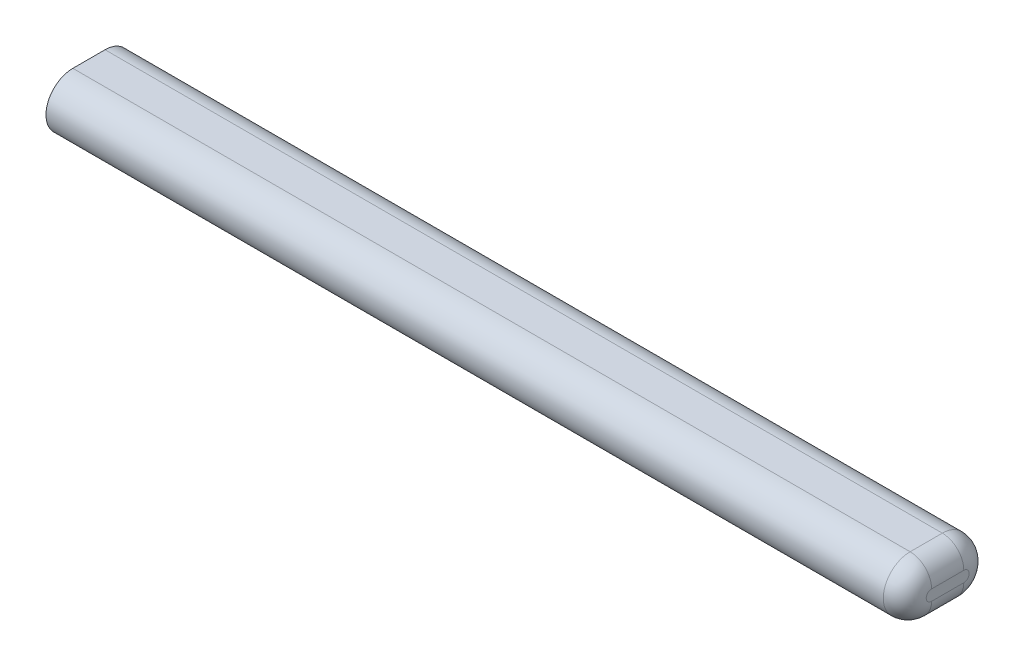
ISO-10303-21;
HEADER;
FILE_DESCRIPTION(('STEP AP214'),'2;1');
FILE_NAME('part.step','',(''),(''),'','','');
FILE_SCHEMA(('AUTOMOTIVE_DESIGN { 1 0 10303 214 1 1 1 1 }'));
ENDSEC;
DATA;
#1=APPLICATION_CONTEXT('core data for automotive mechanical design processes');
#2=APPLICATION_PROTOCOL_DEFINITION('international standard','automotive_design',2000,#1);
#3=PRODUCT_CONTEXT('',#1,'mechanical');
#4=PRODUCT('Part','Part','',(#3));
#5=PRODUCT_RELATED_PRODUCT_CATEGORY('part','',(#4));
#6=PRODUCT_DEFINITION_FORMATION('','',#4);
#7=PRODUCT_DEFINITION_CONTEXT('part definition',#1,'design');
#8=PRODUCT_DEFINITION('design','',#6,#7);
#9=PRODUCT_DEFINITION_SHAPE('','',#8);
#10=(LENGTH_UNIT() NAMED_UNIT(*) SI_UNIT(.MILLI.,.METRE.));
#11=(NAMED_UNIT(*) PLANE_ANGLE_UNIT() SI_UNIT($,.RADIAN.));
#12=(NAMED_UNIT(*) SI_UNIT($,.STERADIAN.) SOLID_ANGLE_UNIT());
#13=UNCERTAINTY_MEASURE_WITH_UNIT(LENGTH_MEASURE(1.E-05),#10,'distance_accuracy_value','');
#14=(GEOMETRIC_REPRESENTATION_CONTEXT(3) GLOBAL_UNCERTAINTY_ASSIGNED_CONTEXT((#13)) GLOBAL_UNIT_ASSIGNED_CONTEXT((#10,
#11,#12)) REPRESENTATION_CONTEXT('',''));
#15=CARTESIAN_POINT('',(0.,0.,0.));
#16=DIRECTION('',(0.,0.,1.));
#17=DIRECTION('',(1.,0.,0.));
#18=AXIS2_PLACEMENT_3D('',#15,#16,#17);
#19=CARTESIAN_POINT('',(400.,0.,0.));
#20=DIRECTION('',(-1.,0.,0.));
#21=DIRECTION('',(0.,0.,1.));
#22=AXIS2_PLACEMENT_3D('',#19,#20,#21);
#23=CYLINDRICAL_SURFACE('',#22,12.5);
#24=DIRECTION('',(-1.,0.,0.));
#25=VECTOR('',#24,1.);
#26=CARTESIAN_POINT('',(400.,-12.5,0.));
#27=LINE('',#26,#25);
#28=CARTESIAN_POINT('',(390.,-12.5,0.));
#29=VERTEX_POINT('',#28);
#30=CARTESIAN_POINT('',(0.,-12.5,0.));
#31=VERTEX_POINT('',#30);
#32=EDGE_CURVE('E92',#29,#31,#27,.T.);
#33=ORIENTED_EDGE('',*,*,#32,.F.);
#34=CARTESIAN_POINT('',(390.,0.,0.));
#35=DIRECTION('',(1.,0.,0.));
#36=DIRECTION('',(0.,0.,-1.));
#37=AXIS2_PLACEMENT_3D('',#34,#35,#36);
#38=CIRCLE('',#37,12.5);
#39=CARTESIAN_POINT('',(390.,12.5,0.));
#40=VERTEX_POINT('',#39);
#41=EDGE_CURVE('E11',#29,#40,#38,.F.);
#42=ORIENTED_EDGE('',*,*,#41,.T.);
#43=DIRECTION('',(-1.,0.,0.));
#44=VECTOR('',#43,1.);
#45=CARTESIAN_POINT('',(400.,12.5,0.));
#46=LINE('',#45,#44);
#47=CARTESIAN_POINT('',(0.,12.5,0.));
#48=VERTEX_POINT('',#47);
#49=EDGE_CURVE('E114',#40,#48,#46,.T.);
#50=ORIENTED_EDGE('',*,*,#49,.T.);
#51=CARTESIAN_POINT('',(0.,0.,0.));
#52=DIRECTION('',(1.,0.,0.));
#53=DIRECTION('',(0.,0.,-1.));
#54=AXIS2_PLACEMENT_3D('',#51,#52,#53);
#55=CIRCLE('',#54,12.5);
#56=EDGE_CURVE('E108',#48,#31,#55,.T.);
#57=ORIENTED_EDGE('',*,*,#56,.T.);
#58=EDGE_LOOP('',(#33,#42,#50,#57));
#59=FACE_BOUND('',#58,.T.);
#60=ADVANCED_FACE('F39',(#59),#23,.T.);
#61=CARTESIAN_POINT('',(400.,-12.5,0.));
#62=DIRECTION('',(0.,1.,0.));
#63=DIRECTION('',(0.,0.,1.));
#64=AXIS2_PLACEMENT_3D('',#61,#62,#63);
#65=PLANE('',#64);
#66=DIRECTION('',(-1.,0.,0.));
#67=VECTOR('',#66,1.);
#68=CARTESIAN_POINT('',(400.,-12.5,-15.));
#69=LINE('',#68,#67);
#70=CARTESIAN_POINT('',(390.,-12.5,-15.));
#71=VERTEX_POINT('',#70);
#72=CARTESIAN_POINT('',(0.,-12.5,-15.));
#73=VERTEX_POINT('',#72);
#74=EDGE_CURVE('E102',#71,#73,#69,.T.);
#75=ORIENTED_EDGE('',*,*,#74,.F.);
#76=DIRECTION('',(0.,0.,-1.));
#77=VECTOR('',#76,1.);
#78=CARTESIAN_POINT('',(390.,-12.5,0.));
#79=LINE('',#78,#77);
#80=EDGE_CURVE('E49',#71,#29,#79,.F.);
#81=ORIENTED_EDGE('',*,*,#80,.T.);
#82=ORIENTED_EDGE('',*,*,#32,.T.);
#83=DIRECTION('',(0.,0.,-1.));
#84=VECTOR('',#83,1.);
#85=CARTESIAN_POINT('',(0.,-12.5,0.));
#86=LINE('',#85,#84);
#87=EDGE_CURVE('E95',#31,#73,#86,.T.);
#88=ORIENTED_EDGE('',*,*,#87,.T.);
#89=EDGE_LOOP('',(#75,#81,#82,#88));
#90=FACE_BOUND('',#89,.T.);
#91=ADVANCED_FACE('F94',(#90),#65,.F.);
#92=CARTESIAN_POINT('',(400.,0.,-15.));
#93=DIRECTION('',(-1.,0.,0.));
#94=DIRECTION('',(0.,0.,1.));
#95=AXIS2_PLACEMENT_3D('',#92,#93,#94);
#96=CYLINDRICAL_SURFACE('',#95,12.5);
#97=DIRECTION('',(-1.,0.,0.));
#98=VECTOR('',#97,1.);
#99=CARTESIAN_POINT('',(400.,12.5,-15.));
#100=LINE('',#99,#98);
#101=CARTESIAN_POINT('',(390.,12.5,-15.));
#102=VERTEX_POINT('',#101);
#103=CARTESIAN_POINT('',(0.,12.5,-15.));
#104=VERTEX_POINT('',#103);
#105=EDGE_CURVE('E129',#102,#104,#100,.T.);
#106=ORIENTED_EDGE('',*,*,#105,.F.);
#107=CARTESIAN_POINT('',(390.,0.,-15.));
#108=DIRECTION('',(1.,0.,0.));
#109=DIRECTION('',(0.,0.,-1.));
#110=AXIS2_PLACEMENT_3D('',#107,#108,#109);
#111=CIRCLE('',#110,12.5);
#112=EDGE_CURVE('E64',#102,#71,#111,.F.);
#113=ORIENTED_EDGE('',*,*,#112,.T.);
#114=ORIENTED_EDGE('',*,*,#74,.T.);
#115=CARTESIAN_POINT('',(0.,0.,-15.));
#116=DIRECTION('',(1.,0.,0.));
#117=DIRECTION('',(0.,0.,-1.));
#118=AXIS2_PLACEMENT_3D('',#115,#116,#117);
#119=CIRCLE('',#118,12.5);
#120=EDGE_CURVE('E110',#73,#104,#119,.T.);
#121=ORIENTED_EDGE('',*,*,#120,.T.);
#122=EDGE_LOOP('',(#106,#113,#114,#121));
#123=FACE_BOUND('',#122,.T.);
#124=ADVANCED_FACE('F179',(#123),#96,.T.);
#125=CARTESIAN_POINT('',(400.,12.5,0.));
#126=DIRECTION('',(0.,-1.,0.));
#127=DIRECTION('',(0.,0.,-1.));
#128=AXIS2_PLACEMENT_3D('',#125,#126,#127);
#129=PLANE('',#128);
#130=ORIENTED_EDGE('',*,*,#49,.F.);
#131=DIRECTION('',(0.,0.,1.));
#132=VECTOR('',#131,1.);
#133=CARTESIAN_POINT('',(390.,12.5,-15.));
#134=LINE('',#133,#132);
#135=EDGE_CURVE('E146',#40,#102,#134,.F.);
#136=ORIENTED_EDGE('',*,*,#135,.T.);
#137=ORIENTED_EDGE('',*,*,#105,.T.);
#138=DIRECTION('',(0.,0.,1.));
#139=VECTOR('',#138,1.);
#140=CARTESIAN_POINT('',(0.,12.5,0.));
#141=LINE('',#140,#139);
#142=EDGE_CURVE('E124',#104,#48,#141,.T.);
#143=ORIENTED_EDGE('',*,*,#142,.T.);
#144=EDGE_LOOP('',(#130,#136,#137,#143));
#145=FACE_BOUND('',#144,.T.);
#146=ADVANCED_FACE('F178',(#145),#129,.F.);
#147=CARTESIAN_POINT('',(400.,0.,0.));
#148=DIRECTION('',(1.,0.,0.));
#149=DIRECTION('',(0.,0.,-1.));
#150=AXIS2_PLACEMENT_3D('',#147,#148,#149);
#151=PLANE('',#150);
#152=CARTESIAN_POINT('',(400.,0.,-15.));
#153=DIRECTION('',(1.,0.,0.));
#154=DIRECTION('',(0.,0.,-1.));
#155=AXIS2_PLACEMENT_3D('',#152,#153,#154);
#156=CIRCLE('',#155,2.5);
#157=CARTESIAN_POINT('',(400.,-2.5,-15.));
#158=VERTEX_POINT('',#157);
#159=CARTESIAN_POINT('',(400.,2.5,-15.));
#160=VERTEX_POINT('',#159);
#161=EDGE_CURVE('E139',#158,#160,#156,.T.);
#162=ORIENTED_EDGE('',*,*,#161,.T.);
#163=DIRECTION('',(0.,0.,1.));
#164=VECTOR('',#163,1.);
#165=CARTESIAN_POINT('',(400.,2.5,0.));
#166=LINE('',#165,#164);
#167=CARTESIAN_POINT('',(400.,2.5,0.));
#168=VERTEX_POINT('',#167);
#169=EDGE_CURVE('E142',#160,#168,#166,.T.);
#170=ORIENTED_EDGE('',*,*,#169,.T.);
#171=CARTESIAN_POINT('',(400.,0.,0.));
#172=DIRECTION('',(1.,0.,0.));
#173=DIRECTION('',(0.,0.,-1.));
#174=AXIS2_PLACEMENT_3D('',#171,#172,#173);
#175=CIRCLE('',#174,2.5);
#176=CARTESIAN_POINT('',(400.,-2.5,0.));
#177=VERTEX_POINT('',#176);
#178=EDGE_CURVE('E101',#168,#177,#175,.T.);
#179=ORIENTED_EDGE('',*,*,#178,.T.);
#180=DIRECTION('',(0.,0.,-1.));
#181=VECTOR('',#180,1.);
#182=CARTESIAN_POINT('',(400.,-2.5,-15.));
#183=LINE('',#182,#181);
#184=EDGE_CURVE('E136',#177,#158,#183,.T.);
#185=ORIENTED_EDGE('',*,*,#184,.T.);
#186=EDGE_LOOP('',(#162,#170,#179,#185));
#187=FACE_BOUND('',#186,.T.);
#188=ADVANCED_FACE('F171',(#187),#151,.T.);
#189=CARTESIAN_POINT('',(0.,0.,0.));
#190=DIRECTION('',(1.,0.,0.));
#191=DIRECTION('',(0.,0.,-1.));
#192=AXIS2_PLACEMENT_3D('',#189,#190,#191);
#193=PLANE('',#192);
#194=ORIENTED_EDGE('',*,*,#56,.F.);
#195=ORIENTED_EDGE('',*,*,#142,.F.);
#196=ORIENTED_EDGE('',*,*,#120,.F.);
#197=ORIENTED_EDGE('',*,*,#87,.F.);
#198=EDGE_LOOP('',(#194,#195,#196,#197));
#199=FACE_BOUND('',#198,.T.);
#200=ADVANCED_FACE('F106',(#199),#193,.F.);
#201=CARTESIAN_POINT('',(390.,-2.5,0.));
#202=DIRECTION('',(0.,0.,1.));
#203=DIRECTION('',(1.,0.,0.));
#204=AXIS2_PLACEMENT_3D('',#201,#202,#203);
#205=CYLINDRICAL_SURFACE('',#204,10.);
#206=CARTESIAN_POINT('',(390.,-2.5,0.));
#207=DIRECTION('',(0.,0.,1.));
#208=DIRECTION('',(1.,0.,0.));
#209=AXIS2_PLACEMENT_3D('',#206,#207,#208);
#210=CIRCLE('',#209,10.);
#211=EDGE_CURVE('E120',#29,#177,#210,.T.);
#212=ORIENTED_EDGE('',*,*,#211,.F.);
#213=ORIENTED_EDGE('',*,*,#80,.F.);
#214=CARTESIAN_POINT('',(390.,-2.5,-15.));
#215=DIRECTION('',(0.,0.,-1.));
#216=DIRECTION('',(0.,1.,0.));
#217=AXIS2_PLACEMENT_3D('',#214,#215,#216);
#218=CIRCLE('',#217,10.);
#219=EDGE_CURVE('E43',#158,#71,#218,.T.);
#220=ORIENTED_EDGE('',*,*,#219,.F.);
#221=ORIENTED_EDGE('',*,*,#184,.F.);
#222=EDGE_LOOP('',(#212,#213,#220,#221));
#223=FACE_BOUND('',#222,.T.);
#224=ADVANCED_FACE('F41',(#223),#205,.T.);
#225=CARTESIAN_POINT('',(390.,0.,-15.));
#226=DIRECTION('',(1.,0.,0.));
#227=DIRECTION('',(0.,0.,-1.));
#228=AXIS2_PLACEMENT_3D('',#225,#226,#227);
#229=DEGENERATE_TOROIDAL_SURFACE('',#228,2.5,10.,.T.);
#230=ORIENTED_EDGE('',*,*,#219,.T.);
#231=ORIENTED_EDGE('',*,*,#112,.F.);
#232=CARTESIAN_POINT('',(390.,2.5,-15.));
#233=DIRECTION('',(0.,0.,1.));
#234=DIRECTION('',(1.,0.,0.));
#235=AXIS2_PLACEMENT_3D('',#232,#233,#234);
#236=CIRCLE('',#235,10.);
#237=EDGE_CURVE('E157',#160,#102,#236,.T.);
#238=ORIENTED_EDGE('',*,*,#237,.F.);
#239=ORIENTED_EDGE('',*,*,#161,.F.);
#240=EDGE_LOOP('',(#230,#231,#238,#239));
#241=FACE_BOUND('',#240,.T.);
#242=ADVANCED_FACE('F196',(#241),#229,.T.);
#243=CARTESIAN_POINT('',(390.,0.,0.));
#244=DIRECTION('',(1.,0.,0.));
#245=DIRECTION('',(0.,0.,-1.));
#246=AXIS2_PLACEMENT_3D('',#243,#244,#245);
#247=DEGENERATE_TOROIDAL_SURFACE('',#246,2.5,10.,.T.);
#248=ORIENTED_EDGE('',*,*,#211,.T.);
#249=ORIENTED_EDGE('',*,*,#178,.F.);
#250=CARTESIAN_POINT('',(390.,2.5,0.));
#251=DIRECTION('',(0.,0.,-1.));
#252=DIRECTION('',(-1.,0.,0.));
#253=AXIS2_PLACEMENT_3D('',#250,#251,#252);
#254=CIRCLE('',#253,10.);
#255=EDGE_CURVE('E154',#40,#168,#254,.T.);
#256=ORIENTED_EDGE('',*,*,#255,.F.);
#257=ORIENTED_EDGE('',*,*,#41,.F.);
#258=EDGE_LOOP('',(#248,#249,#256,#257));
#259=FACE_BOUND('',#258,.T.);
#260=ADVANCED_FACE('F164',(#259),#247,.T.);
#261=CARTESIAN_POINT('',(390.,2.5,0.));
#262=DIRECTION('',(0.,0.,-1.));
#263=DIRECTION('',(-1.,0.,0.));
#264=AXIS2_PLACEMENT_3D('',#261,#262,#263);
#265=CYLINDRICAL_SURFACE('',#264,10.);
#266=ORIENTED_EDGE('',*,*,#237,.T.);
#267=ORIENTED_EDGE('',*,*,#135,.F.);
#268=ORIENTED_EDGE('',*,*,#255,.T.);
#269=ORIENTED_EDGE('',*,*,#169,.F.);
#270=EDGE_LOOP('',(#266,#267,#268,#269));
#271=FACE_BOUND('',#270,.T.);
#272=ADVANCED_FACE('F175',(#271),#265,.T.);
#273=CLOSED_SHELL('',(#60,#91,#124,#146,#188,#200,#224,#242,#260,#272));
#274=MANIFOLD_SOLID_BREP('B2',#273);
#275=ADVANCED_BREP_SHAPE_REPRESENTATION('',(#18,#274),#14);
#276=SHAPE_DEFINITION_REPRESENTATION(#9,#275);
ENDSEC;
END-ISO-10303-21;
